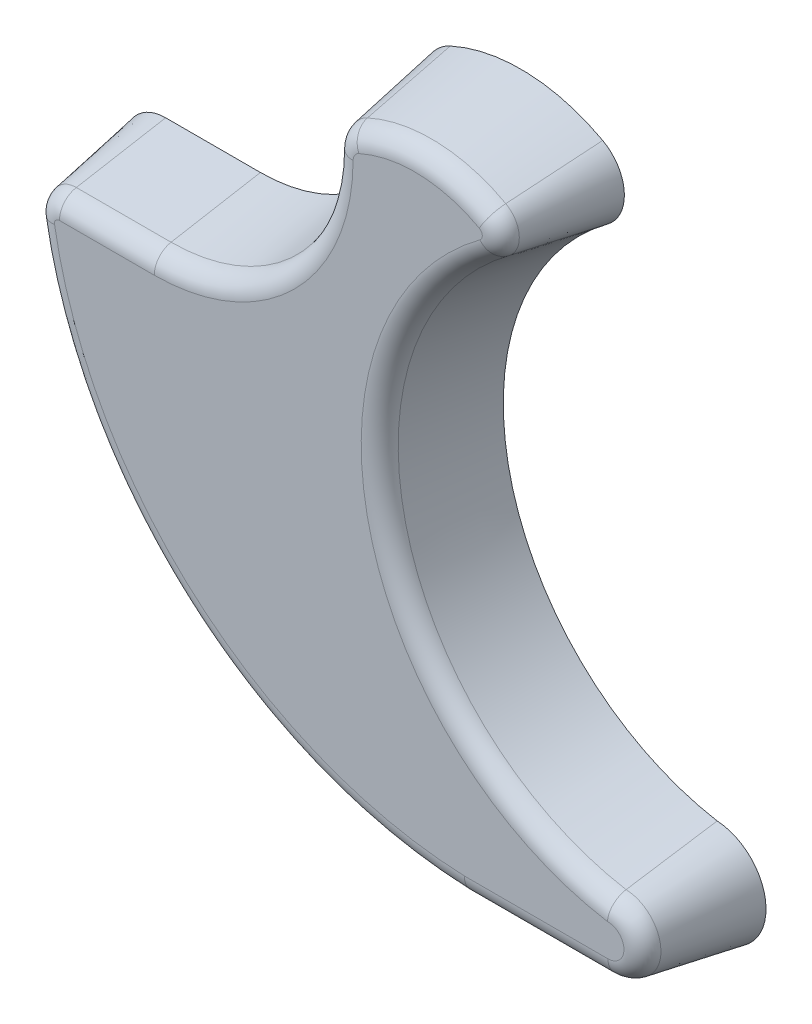
ISO-10303-21;
HEADER;
FILE_DESCRIPTION(('STEP AP214'),'2;1');
FILE_NAME('part.step','',(''),(''),'','','');
FILE_SCHEMA(('AUTOMOTIVE_DESIGN { 1 0 10303 214 1 1 1 1 }'));
ENDSEC;
DATA;
#1=APPLICATION_CONTEXT('core data for automotive mechanical design processes');
#2=APPLICATION_PROTOCOL_DEFINITION('international standard','automotive_design',2000,#1);
#3=PRODUCT_CONTEXT('',#1,'mechanical');
#4=PRODUCT('Part','Part','',(#3));
#5=PRODUCT_RELATED_PRODUCT_CATEGORY('part','',(#4));
#6=PRODUCT_DEFINITION_FORMATION('','',#4);
#7=PRODUCT_DEFINITION_CONTEXT('part definition',#1,'design');
#8=PRODUCT_DEFINITION('design','',#6,#7);
#9=PRODUCT_DEFINITION_SHAPE('','',#8);
#10=(LENGTH_UNIT() NAMED_UNIT(*) SI_UNIT(.MILLI.,.METRE.));
#11=(NAMED_UNIT(*) PLANE_ANGLE_UNIT() SI_UNIT($,.RADIAN.));
#12=(NAMED_UNIT(*) SI_UNIT($,.STERADIAN.) SOLID_ANGLE_UNIT());
#13=UNCERTAINTY_MEASURE_WITH_UNIT(LENGTH_MEASURE(1.E-05),#10,'distance_accuracy_value','');
#14=(GEOMETRIC_REPRESENTATION_CONTEXT(3) GLOBAL_UNCERTAINTY_ASSIGNED_CONTEXT((#13)) GLOBAL_UNIT_ASSIGNED_CONTEXT((#10,
#11,#12)) REPRESENTATION_CONTEXT('',''));
#15=CARTESIAN_POINT('',(0.,0.,0.));
#16=DIRECTION('',(0.,0.,1.));
#17=DIRECTION('',(1.,0.,0.));
#18=AXIS2_PLACEMENT_3D('',#15,#16,#17);
#19=CARTESIAN_POINT('',(-185.360620238029,11.7361066888979,0.));
#20=DIRECTION('',(0.,0.,-1.));
#21=DIRECTION('',(1.,0.,0.));
#22=AXIS2_PLACEMENT_3D('',#19,#20,#21);
#23=CONICAL_SURFACE('',#22,12.7,0.174532925199433);
#24=DIRECTION('',(-0.171170743391447,-0.0292278328629598,-0.984807753012208));
#25=VECTOR('',#24,1.);
#26=CARTESIAN_POINT('',(-197.879429650708,9.59848864794411,0.));
#27=LINE('',#26,#25);
#28=CARTESIAN_POINT('',(-193.052225703188,10.4227458041505,27.772665928185));
#29=VERTEX_POINT('',#28);
#30=CARTESIAN_POINT('',(-197.879429650708,9.59848864794409,0.));
#31=VERTEX_POINT('',#30);
#32=EDGE_CURVE('E147',#29,#31,#27,.T.);
#33=ORIENTED_EDGE('',*,*,#32,.F.);
#34=CARTESIAN_POINT('',(-185.360620238029,11.7361066888979,27.772665928185));
#35=DIRECTION('',(0.,0.,-1.));
#36=DIRECTION('',(-1.,0.,0.));
#37=AXIS2_PLACEMENT_3D('',#34,#35,#36);
#38=CIRCLE('',#37,7.80292967065828);
#39=CARTESIAN_POINT('',(-185.360620238029,19.5390363595562,27.772665928185));
#40=VERTEX_POINT('',#39);
#41=EDGE_CURVE('E46',#29,#40,#38,.T.);
#42=ORIENTED_EDGE('',*,*,#41,.T.);
#43=DIRECTION('',(0.,0.17364817766693,-0.984807753012208));
#44=VECTOR('',#43,1.);
#45=CARTESIAN_POINT('',(-185.360620238029,24.4361066888979,0.));
#46=LINE('',#45,#44);
#47=CARTESIAN_POINT('',(-185.360620238029,24.4361066888979,0.));
#48=VERTEX_POINT('',#47);
#49=EDGE_CURVE('E168',#40,#48,#46,.T.);
#50=ORIENTED_EDGE('',*,*,#49,.T.);
#51=CARTESIAN_POINT('',(-185.360620238029,11.7361066888979,0.));
#52=DIRECTION('',(0.,0.,1.));
#53=DIRECTION('',(1.,0.,0.));
#54=AXIS2_PLACEMENT_3D('',#51,#52,#53);
#55=CIRCLE('',#54,12.7);
#56=EDGE_CURVE('E162',#48,#31,#55,.T.);
#57=ORIENTED_EDGE('',*,*,#56,.T.);
#58=EDGE_LOOP('',(#33,#42,#50,#57));
#59=FACE_BOUND('',#58,.T.);
#60=ADVANCED_FACE('F37',(#59),#23,.T.);
#61=CARTESIAN_POINT('',(-54.3378571428572,34.1085714285715,0.));
#62=DIRECTION('',(0.,0.,-1.));
#63=DIRECTION('',(1.,0.,0.));
#64=AXIS2_PLACEMENT_3D('',#61,#62,#63);
#65=CONICAL_SURFACE('',#64,145.619116862931,0.174532925199433);
#66=CARTESIAN_POINT('',(-59.5693856344838,-105.59030612125,33.02));
#67=CARTESIAN_POINT('',(-59.5875471806484,-106.560692169269,27.5166672478581));
#68=CARTESIAN_POINT('',(-59.6056170011073,-107.531078268531,22.0133342051054));
#69=CARTESIAN_POINT('',(-59.6415731906139,-109.471850569529,11.0066675384387));
#70=CARTESIAN_POINT('',(-59.6594595596615,-110.442236771265,5.50333391452478));
#71=CARTESIAN_POINT('',(-59.6772542030036,-111.412623024244,0.));
#72=B_SPLINE_CURVE_WITH_KNOTS('',3,(#66,#67,#68,#69,#70,#71),.UNSPECIFIED.,.F.,.F.,(4,2,4),(0.,
16.7647801213005,33.5295602424167),.UNSPECIFIED.);
#73=CARTESIAN_POINT('',(-59.5866755915734,-106.515552694902,27.772665928185));
#74=VERTEX_POINT('',#73);
#75=CARTESIAN_POINT('',(-59.6772542030037,-111.412623024244,0.));
#76=VERTEX_POINT('',#75);
#77=EDGE_CURVE('E156',#74,#76,#72,.T.);
#78=ORIENTED_EDGE('',*,*,#77,.F.);
#79=CARTESIAN_POINT('',(-54.3378571428572,34.1085714285715,27.772665928185));
#80=DIRECTION('',(0.,0.,-1.));
#81=DIRECTION('',(-1.,0.,0.));
#82=AXIS2_PLACEMENT_3D('',#79,#80,#81);
#83=CIRCLE('',#82,140.722046533589);
#84=EDGE_CURVE('E54',#74,#29,#83,.T.);
#85=ORIENTED_EDGE('',*,*,#84,.T.);
#86=ORIENTED_EDGE('',*,*,#32,.T.);
#87=CARTESIAN_POINT('',(-54.3378571428572,34.1085714285715,0.));
#88=DIRECTION('',(0.,0.,1.));
#89=DIRECTION('',(1.,0.,0.));
#90=AXIS2_PLACEMENT_3D('',#87,#88,#89);
#91=CIRCLE('',#90,145.619116862931);
#92=EDGE_CURVE('E150',#31,#76,#91,.T.);
#93=ORIENTED_EDGE('',*,*,#92,.T.);
#94=EDGE_LOOP('',(#78,#85,#86,#93));
#95=FACE_BOUND('',#94,.T.);
#96=ADVANCED_FACE('F149',(#95),#65,.T.);
#97=CARTESIAN_POINT('',(-14.8204641625524,-111.412623024244,0.));
#98=DIRECTION('',(0.,-0.984807753012208,0.17364817766693));
#99=DIRECTION('',(0.,-0.17364817766693,-0.984807753012208));
#100=AXIS2_PLACEMENT_3D('',#97,#98,#99);
#101=PLANE('',#100);
#102=DIRECTION('',(0.,-0.17364817766693,-0.984807753012208));
#103=VECTOR('',#102,1.);
#104=CARTESIAN_POINT('',(-14.8204641625524,-111.412623024244,0.));
#105=LINE('',#104,#103);
#106=CARTESIAN_POINT('',(-14.8204641625524,-106.515552694902,27.772665928185));
#107=VERTEX_POINT('',#106);
#108=CARTESIAN_POINT('',(-14.8204641625524,-111.412623024244,0.));
#109=VERTEX_POINT('',#108);
#110=EDGE_CURVE('E213',#107,#109,#105,.T.);
#111=ORIENTED_EDGE('',*,*,#110,.F.);
#112=DIRECTION('',(1.,0.,0.));
#113=VECTOR('',#112,1.);
#114=CARTESIAN_POINT('',(-59.5693856344838,-106.515552694902,27.772665928185));
#115=LINE('',#114,#113);
#116=EDGE_CURVE('E62',#107,#74,#115,.F.);
#117=ORIENTED_EDGE('',*,*,#116,.T.);
#118=ORIENTED_EDGE('',*,*,#77,.T.);
#119=DIRECTION('',(1.,0.,0.));
#120=VECTOR('',#119,1.);
#121=CARTESIAN_POINT('',(-14.8204641625524,-111.412623024244,0.));
#122=LINE('',#121,#120);
#123=EDGE_CURVE('E165',#76,#109,#122,.T.);
#124=ORIENTED_EDGE('',*,*,#123,.T.);
#125=EDGE_LOOP('',(#111,#117,#118,#124));
#126=FACE_BOUND('',#125,.T.);
#127=ADVANCED_FACE('F224',(#126),#101,.T.);
#128=CARTESIAN_POINT('',(-14.8204641625524,-95.2797373334966,0.));
#129=DIRECTION('',(0.,0.,-1.));
#130=DIRECTION('',(1.,0.,0.));
#131=AXIS2_PLACEMENT_3D('',#128,#129,#130);
#132=CONICAL_SURFACE('',#131,16.1328856907471,0.174532925199433);
#133=CARTESIAN_POINT('',(-14.5084201854811,-84.9738915514478,33.02));
#134=CARTESIAN_POINT('',(-14.4576699848428,-84.4667315076806,30.1363427169767));
#135=CARTESIAN_POINT('',(-14.4055154966712,-83.9597875854176,27.2526724951651));
#136=CARTESIAN_POINT('',(-14.298771530745,-82.946275030161,21.4853126478576));
#137=CARTESIAN_POINT('',(-14.2441820542456,-82.4397063969741,18.6016230223724));
#138=CARTESIAN_POINT('',(-14.1380346976066,-81.4732580751137,13.0982834606489));
#139=CARTESIAN_POINT('',(-14.0866569393928,-81.0133506172318,10.4786349139742));
#140=CARTESIAN_POINT('',(-13.9823836772579,-80.093769615867,5.23932569271442));
#141=CARTESIAN_POINT('',(-13.9294881726286,-79.6340960724934,2.61966501812434));
#142=CARTESIAN_POINT('',(-13.8759255527134,-79.1745255210044,0.));
#143=B_SPLINE_CURVE_WITH_KNOTS('',3,(#133,#134,#135,#136,#137,#138,#139,#140,#141,#142),
.UNSPECIFIED.,.F.,.F.,(4,2,2,2,4),(0.,8.78506579771062,17.5701270661008,25.5507542714873,
33.5313852005815),.UNSPECIFIED.);
#144=CARTESIAN_POINT('',(-14.414570908634,-84.0512558020502,27.772665928185));
#145=VERTEX_POINT('',#144);
#146=CARTESIAN_POINT('',(-13.8759255527136,-79.1745255210044,0.));
#147=VERTEX_POINT('',#146);
#148=EDGE_CURVE('E205',#145,#147,#143,.T.);
#149=ORIENTED_EDGE('',*,*,#148,.F.);
#150=CARTESIAN_POINT('',(-14.8204641625524,-95.2797373334966,27.772665928185));
#151=DIRECTION('',(0.,0.,-1.));
#152=DIRECTION('',(-1.,0.,0.));
#153=AXIS2_PLACEMENT_3D('',#150,#151,#152);
#154=CIRCLE('',#153,11.2358153614054);
#155=EDGE_CURVE('E254',#145,#107,#154,.T.);
#156=ORIENTED_EDGE('',*,*,#155,.T.);
#157=ORIENTED_EDGE('',*,*,#110,.T.);
#158=CARTESIAN_POINT('',(-14.8204641625524,-95.2797373334966,0.));
#159=DIRECTION('',(0.,0.,1.));
#160=DIRECTION('',(1.,0.,0.));
#161=AXIS2_PLACEMENT_3D('',#158,#159,#160);
#162=CIRCLE('',#161,16.1328856907471);
#163=EDGE_CURVE('E175',#109,#147,#162,.T.);
#164=ORIENTED_EDGE('',*,*,#163,.T.);
#165=EDGE_LOOP('',(#149,#156,#157,#164));
#166=FACE_BOUND('',#165,.T.);
#167=ADVANCED_FACE('F215',(#166),#132,.T.);
#168=CARTESIAN_POINT('',(0.,0.,0.));
#169=DIRECTION('',(0.,0.,1.));
#170=DIRECTION('',(1.,0.,0.));
#171=AXIS2_PLACEMENT_3D('',#168,#169,#170);
#172=CONICAL_SURFACE('',#171,80.3812590186333,0.174532925199433);
#173=DIRECTION('',(0.103597979577627,-0.139359779830765,-0.984807753012208));
#174=VECTOR('',#173,1.);
#175=CARTESIAN_POINT('',(-47.9552169341434,64.5092549191189,0.));
#176=LINE('',#175,#174);
#177=CARTESIAN_POINT('',(-50.8767943372904,68.4393545728096,27.772665928185));
#178=VERTEX_POINT('',#177);
#179=CARTESIAN_POINT('',(-47.9552169341434,64.5092549191189,0.));
#180=VERTEX_POINT('',#179);
#181=EDGE_CURVE('E203',#178,#180,#176,.T.);
#182=ORIENTED_EDGE('',*,*,#181,.F.);
#183=CARTESIAN_POINT('',(0.,0.,27.772665928185));
#184=DIRECTION('',(0.,0.,1.));
#185=DIRECTION('',(1.,0.,0.));
#186=AXIS2_PLACEMENT_3D('',#183,#184,#185);
#187=CIRCLE('',#186,85.2783293479751);
#188=EDGE_CURVE('E252',#178,#145,#187,.T.);
#189=ORIENTED_EDGE('',*,*,#188,.T.);
#190=ORIENTED_EDGE('',*,*,#148,.T.);
#191=CARTESIAN_POINT('',(0.,0.,0.));
#192=DIRECTION('',(0.,0.,-1.));
#193=DIRECTION('',(1.,0.,0.));
#194=AXIS2_PLACEMENT_3D('',#191,#192,#193);
#195=CIRCLE('',#194,80.3812590186333);
#196=EDGE_CURVE('E178',#147,#180,#195,.T.);
#197=ORIENTED_EDGE('',*,*,#196,.T.);
#198=EDGE_LOOP('',(#182,#189,#190,#197));
#199=FACE_BOUND('',#198,.T.);
#200=ADVANCED_FACE('F218',(#199),#172,.F.);
#201=CARTESIAN_POINT('',(-55.6835343025102,74.9053708598825,0.));
#202=DIRECTION('',(0.,0.,-1.));
#203=DIRECTION('',(1.,0.,0.));
#204=AXIS2_PLACEMENT_3D('',#201,#202,#203);
#205=CONICAL_SURFACE('',#204,12.954,0.174532925199433);
#206=DIRECTION('',(0.083292428567465,0.152368175648262,-0.984807753012208));
#207=VECTOR('',#206,1.);
#208=CARTESIAN_POINT('',(-49.4699930252013,86.2719015880853,0.));
#209=LINE('',#208,#207);
#210=CARTESIAN_POINT('',(-51.8189314711832,81.9749508102072,27.772665928185));
#211=VERTEX_POINT('',#210);
#212=CARTESIAN_POINT('',(-49.4699930252013,86.2719015880853,0.));
#213=VERTEX_POINT('',#212);
#214=EDGE_CURVE('E201',#211,#213,#209,.T.);
#215=ORIENTED_EDGE('',*,*,#214,.F.);
#216=CARTESIAN_POINT('',(-55.6835343025102,74.9053708598825,27.772665928185));
#217=DIRECTION('',(0.,0.,-1.));
#218=DIRECTION('',(-1.,0.,0.));
#219=AXIS2_PLACEMENT_3D('',#216,#217,#218);
#220=CIRCLE('',#219,8.05692967065828);
#221=EDGE_CURVE('E250',#211,#178,#220,.T.);
#222=ORIENTED_EDGE('',*,*,#221,.T.);
#223=ORIENTED_EDGE('',*,*,#181,.T.);
#224=CARTESIAN_POINT('',(-55.6835343025102,74.9053708598825,0.));
#225=DIRECTION('',(0.,0.,1.));
#226=DIRECTION('',(1.,0.,0.));
#227=AXIS2_PLACEMENT_3D('',#224,#225,#226);
#228=CIRCLE('',#227,12.954);
#229=EDGE_CURVE('E181',#180,#213,#228,.T.);
#230=ORIENTED_EDGE('',*,*,#229,.T.);
#231=EDGE_LOOP('',(#215,#222,#223,#230));
#232=FACE_BOUND('',#231,.T.);
#233=ADVANCED_FACE('F222',(#232),#205,.T.);
#234=CARTESIAN_POINT('',(-74.9012734880693,39.7500523015337,0.));
#235=DIRECTION('',(0.,0.,-1.));
#236=DIRECTION('',(-1.,0.,0.));
#237=AXIS2_PLACEMENT_3D('',#234,#235,#236);
#238=CONICAL_SURFACE('',#237,53.0191709386489,0.174532925199433);
#239=DIRECTION('',(-0.0719851822336261,0.158024754851376,-0.984807753012208));
#240=VECTOR('',#239,1.);
#241=CARTESIAN_POINT('',(-96.8801662882858,87.9989979718617,0.));
#242=LINE('',#241,#240);
#243=CARTESIAN_POINT('',(-94.85010467287,83.5425254152162,27.772665928185));
#244=VERTEX_POINT('',#243);
#245=CARTESIAN_POINT('',(-96.8801662882858,87.9989979718617,0.));
#246=VERTEX_POINT('',#245);
#247=EDGE_CURVE('E199',#244,#246,#242,.T.);
#248=ORIENTED_EDGE('',*,*,#247,.F.);
#249=CARTESIAN_POINT('',(-74.9012734880693,39.7500523015337,27.772665928185));
#250=DIRECTION('',(0.,0.,-1.));
#251=DIRECTION('',(-1.,0.,0.));
#252=AXIS2_PLACEMENT_3D('',#249,#250,#251);
#253=CIRCLE('',#252,48.1221006093071);
#254=EDGE_CURVE('E248',#244,#211,#253,.T.);
#255=ORIENTED_EDGE('',*,*,#254,.T.);
#256=ORIENTED_EDGE('',*,*,#214,.T.);
#257=CARTESIAN_POINT('',(-74.9012734880693,39.7500523015337,0.));
#258=DIRECTION('',(0.,0.,1.));
#259=DIRECTION('',(-1.,0.,0.));
#260=AXIS2_PLACEMENT_3D('',#257,#258,#259);
#261=CIRCLE('',#260,53.0191709386489);
#262=EDGE_CURVE('E184',#213,#246,#261,.T.);
#263=ORIENTED_EDGE('',*,*,#262,.T.);
#264=EDGE_LOOP('',(#248,#255,#256,#263));
#265=FACE_BOUND('',#264,.T.);
#266=ADVANCED_FACE('F279',(#265),#238,.T.);
#267=CARTESIAN_POINT('',(-90.9836619549375,75.054755520223,0.));
#268=DIRECTION('',(0.,0.,-1.));
#269=DIRECTION('',(-1.,0.,0.));
#270=AXIS2_PLACEMENT_3D('',#267,#268,#269);
#271=CONICAL_SURFACE('',#270,14.224,0.174532925199433);
#272=DIRECTION('',(-0.173647503199055,0.000483983243590093,-0.984807753012208));
#273=VECTOR('',#272,1.);
#274=CARTESIAN_POINT('',(-105.207606707418,75.0943999193139,0.));
#275=LINE('',#274,#273);
#276=CARTESIAN_POINT('',(-100.310555398815,75.080751057495,27.772665928185));
#277=VERTEX_POINT('',#276);
#278=CARTESIAN_POINT('',(-105.207606707418,75.0943999193139,0.));
#279=VERTEX_POINT('',#278);
#280=EDGE_CURVE('E197',#277,#279,#275,.T.);
#281=ORIENTED_EDGE('',*,*,#280,.F.);
#282=CARTESIAN_POINT('',(-90.9836619549375,75.054755520223,27.772665928185));
#283=DIRECTION('',(0.,0.,-1.));
#284=DIRECTION('',(-1.,0.,0.));
#285=AXIS2_PLACEMENT_3D('',#282,#283,#284);
#286=CIRCLE('',#285,9.32692967065828);
#287=EDGE_CURVE('E245',#277,#244,#286,.T.);
#288=ORIENTED_EDGE('',*,*,#287,.T.);
#289=ORIENTED_EDGE('',*,*,#247,.T.);
#290=CARTESIAN_POINT('',(-90.9836619549375,75.054755520223,0.));
#291=DIRECTION('',(0.,0.,1.));
#292=DIRECTION('',(-1.,0.,0.));
#293=AXIS2_PLACEMENT_3D('',#290,#291,#292);
#294=CIRCLE('',#293,14.224);
#295=EDGE_CURVE('E187',#246,#279,#294,.T.);
#296=ORIENTED_EDGE('',*,*,#295,.T.);
#297=EDGE_LOOP('',(#281,#288,#289,#296));
#298=FACE_BOUND('',#297,.T.);
#299=ADVANCED_FACE('F275',(#298),#271,.T.);
#300=CARTESIAN_POINT('',(-156.007409394849,75.235987058924,0.));
#301=DIRECTION('',(0.,0.,1.));
#302=DIRECTION('',(1.,0.,0.));
#303=AXIS2_PLACEMENT_3D('',#300,#301,#302);
#304=CONICAL_SURFACE('',#303,50.8,0.174532925199433);
#305=CARTESIAN_POINT('',(-156.007409394849,75.235987058924,0.));
#306=DIRECTION('',(0.,0.,-1.));
#307=DIRECTION('',(1.,0.,0.));
#308=AXIS2_PLACEMENT_3D('',#305,#306,#307);
#309=CIRCLE('',#308,50.8);
#310=CARTESIAN_POINT('',(-155.897162440074,24.4361066888979,0.));
#311=VERTEX_POINT('',#310);
#312=EDGE_CURVE('E190',#279,#311,#309,.T.);
#313=ORIENTED_EDGE('',*,*,#312,.T.);
#314=DIRECTION('',(0.,0.17364817766693,-0.984807753012208));
#315=VECTOR('',#314,1.);
#316=CARTESIAN_POINT('',(-155.897162440074,24.4361066888979,0.));
#317=LINE('',#316,#315);
#318=CARTESIAN_POINT('',(-155.897162440074,19.5390363595562,27.772665928185));
#319=VERTEX_POINT('',#318);
#320=EDGE_CURVE('E196',#319,#311,#317,.T.);
#321=ORIENTED_EDGE('',*,*,#320,.F.);
#322=CARTESIAN_POINT('',(-155.897162419882,19.5390261584773,27.772664129456));
#323=CARTESIAN_POINT('',(-155.896946103333,19.5390265734407,27.7726642044031));
#324=CARTESIAN_POINT('',(-155.896729786787,19.5390269896643,27.7726642793501));
#325=CARTESIAN_POINT('',(-155.8962971537,19.5390278246318,27.7726644292442));
#326=CARTESIAN_POINT('',(-155.896080837158,19.5390282433757,27.7726645041912));
#327=CARTESIAN_POINT('',(-155.89564820408,19.539029083384,27.7726646540853));
#328=CARTESIAN_POINT('',(-155.895431887544,19.5390295046484,27.7726647290324));
#329=CARTESIAN_POINT('',(-155.894999254475,19.5390303496975,27.7726648789264));
#330=CARTESIAN_POINT('',(-155.894782937943,19.5390307734823,27.7726649538735));
#331=CARTESIAN_POINT('',(-155.894350304884,19.5390316235722,27.7726651037676));
#332=CARTESIAN_POINT('',(-155.894133988357,19.5390320498773,27.7726651787146));
#333=CARTESIAN_POINT('',(-155.893701355308,19.539032905008,27.7726653286087));
#334=CARTESIAN_POINT('',(-155.893485038785,19.5390333338336,27.7726654035557));
#335=CARTESIAN_POINT('',(-155.893052405746,19.5390341940051,27.7726655534498));
#336=CARTESIAN_POINT('',(-155.892836089228,19.539034625351,27.7726656283968));
#337=CARTESIAN_POINT('',(-155.892403456199,19.5390354905633,27.7726657782909));
#338=CARTESIAN_POINT('',(-155.892187139686,19.5390359244297,27.772665853238));
#339=CARTESIAN_POINT('',(-155.891970823176,19.5390363595562,27.772665928185));
#340=B_SPLINE_CURVE_WITH_KNOTS('',3,(#322,#323,#324,#325,#326,#327,#328,#329,#330,#331,#332,
#333,#334,#335,#336,#337,#338,#339),.UNSPECIFIED.,.F.,.F.,(4,2,2,2,2,2,2,2,4),(0.,
0.000648950878562804,0.00129790175753535,0.00194685263697801,0.00259580351692334,
0.0032447543973207,0.00389370527814713,0.00454265615943524,0.00519160704124536),.UNSPECIFIED.);
#341=CARTESIAN_POINT('',(-155.891970823176,19.5390363595562,27.772665928185));
#342=VERTEX_POINT('',#341);
#343=EDGE_CURVE('E11',#319,#342,#340,.T.);
#344=ORIENTED_EDGE('',*,*,#343,.T.);
#345=CARTESIAN_POINT('',(-156.007409394849,75.235987058924,27.772665928185));
#346=DIRECTION('',(0.,0.,1.));
#347=DIRECTION('',(1.,0.,0.));
#348=AXIS2_PLACEMENT_3D('',#345,#346,#347);
#349=CIRCLE('',#348,55.6970703293417);
#350=EDGE_CURVE('E243',#342,#277,#349,.T.);
#351=ORIENTED_EDGE('',*,*,#350,.T.);
#352=ORIENTED_EDGE('',*,*,#280,.T.);
#353=EDGE_LOOP('',(#313,#321,#344,#351,#352));
#354=FACE_BOUND('',#353,.T.);
#355=ADVANCED_FACE('F264',(#354),#304,.F.);
#356=CARTESIAN_POINT('',(-185.360620238029,24.4361066888979,0.));
#357=DIRECTION('',(0.,0.984807753012208,0.17364817766693));
#358=DIRECTION('',(0.,-0.17364817766693,0.984807753012208));
#359=AXIS2_PLACEMENT_3D('',#356,#357,#358);
#360=PLANE('',#359);
#361=ORIENTED_EDGE('',*,*,#49,.F.);
#362=DIRECTION('',(-1.,0.,0.));
#363=VECTOR('',#362,1.);
#364=CARTESIAN_POINT('',(-155.897162440074,19.5390363595562,27.772665928185));
#365=LINE('',#364,#363);
#366=EDGE_CURVE('E246',#40,#319,#365,.F.);
#367=ORIENTED_EDGE('',*,*,#366,.T.);
#368=ORIENTED_EDGE('',*,*,#320,.T.);
#369=DIRECTION('',(-1.,0.,0.));
#370=VECTOR('',#369,1.);
#371=CARTESIAN_POINT('',(-185.360620238029,24.4361066888979,0.));
#372=LINE('',#371,#370);
#373=EDGE_CURVE('E193',#311,#48,#372,.T.);
#374=ORIENTED_EDGE('',*,*,#373,.T.);
#375=EDGE_LOOP('',(#361,#367,#368,#374));
#376=FACE_BOUND('',#375,.T.);
#377=ADVANCED_FACE('F274',(#376),#360,.T.);
#378=CARTESIAN_POINT('',(-185.360620238029,11.7361066888979,33.02));
#379=DIRECTION('',(0.,0.,1.));
#380=DIRECTION('',(1.,0.,0.));
#381=AXIS2_PLACEMENT_3D('',#378,#379,#380);
#382=PLANE('',#381);
#383=CARTESIAN_POINT('',(-156.007409394849,75.235987058924,33.02));
#384=DIRECTION('',(0.,0.,1.));
#385=DIRECTION('',(1.,0.,0.));
#386=AXIS2_PLACEMENT_3D('',#383,#384,#385);
#387=CIRCLE('',#386,61.9505995609693);
#388=CARTESIAN_POINT('',(-94.0570504565561,75.0633215433931,33.02));
#389=VERTEX_POINT('',#388);
#390=CARTESIAN_POINT('',(-155.885662596501,13.2855071279287,33.02));
#391=VERTEX_POINT('',#390);
#392=EDGE_CURVE('E399',#389,#391,#387,.F.);
#393=ORIENTED_EDGE('',*,*,#392,.T.);
#394=DIRECTION('',(1.,0.,0.));
#395=VECTOR('',#394,1.);
#396=CARTESIAN_POINT('',(-185.360620238029,13.2855071279287,33.02));
#397=LINE('',#396,#395);
#398=CARTESIAN_POINT('',(-185.360620238029,13.2855071279287,33.02));
#399=VERTEX_POINT('',#398);
#400=EDGE_CURVE('E241',#391,#399,#397,.F.);
#401=ORIENTED_EDGE('',*,*,#400,.T.);
#402=CARTESIAN_POINT('',(-185.360620238029,11.7361066888979,33.02));
#403=DIRECTION('',(0.,0.,1.));
#404=DIRECTION('',(1.,0.,0.));
#405=AXIS2_PLACEMENT_3D('',#402,#403,#404);
#406=CIRCLE('',#405,1.54940043903076);
#407=CARTESIAN_POINT('',(-186.887915419143,11.4753172140055,33.02));
#408=VERTEX_POINT('',#407);
#409=EDGE_CURVE('E155',#399,#408,#406,.T.);
#410=ORIENTED_EDGE('',*,*,#409,.T.);
#411=CARTESIAN_POINT('',(-54.3378571428572,34.1085714285715,33.02));
#412=DIRECTION('',(0.,0.,1.));
#413=DIRECTION('',(1.,0.,0.));
#414=AXIS2_PLACEMENT_3D('',#411,#412,#413);
#415=CIRCLE('',#414,134.468517301962);
#416=CARTESIAN_POINT('',(-59.4686829827589,-100.262023463274,33.02));
#417=VERTEX_POINT('',#416);
#418=EDGE_CURVE('E408',#408,#417,#415,.T.);
#419=ORIENTED_EDGE('',*,*,#418,.T.);
#420=DIRECTION('',(-1.,0.,0.));
#421=VECTOR('',#420,1.);
#422=CARTESIAN_POINT('',(-14.8204641625524,-100.262023463274,33.02));
#423=LINE('',#422,#421);
#424=CARTESIAN_POINT('',(-14.8204641625524,-100.262023463274,33.02));
#425=VERTEX_POINT('',#424);
#426=EDGE_CURVE('E407',#417,#425,#423,.F.);
#427=ORIENTED_EDGE('',*,*,#426,.T.);
#428=CARTESIAN_POINT('',(-14.8204641625524,-95.2797373334966,33.02));
#429=DIRECTION('',(0.,0.,1.));
#430=DIRECTION('',(1.,0.,0.));
#431=AXIS2_PLACEMENT_3D('',#428,#429,#430);
#432=CIRCLE('',#431,4.98228612977788);
#433=CARTESIAN_POINT('',(-14.9684485218816,-90.2996494117455,33.02));
#434=VERTEX_POINT('',#433);
#435=EDGE_CURVE('E405',#425,#434,#432,.T.);
#436=ORIENTED_EDGE('',*,*,#435,.T.);
#437=CARTESIAN_POINT('',(0.,0.,33.02));
#438=DIRECTION('',(0.,0.,1.));
#439=DIRECTION('',(1.,0.,0.));
#440=AXIS2_PLACEMENT_3D('',#437,#438,#439);
#441=CIRCLE('',#440,91.5318585796026);
#442=CARTESIAN_POINT('',(-54.6076310344014,73.4580680922596,33.02));
#443=VERTEX_POINT('',#442);
#444=EDGE_CURVE('E379',#434,#443,#441,.F.);
#445=ORIENTED_EDGE('',*,*,#444,.T.);
#446=CARTESIAN_POINT('',(-55.6835343025102,74.9053708598825,33.02));
#447=DIRECTION('',(0.,0.,1.));
#448=DIRECTION('',(1.,0.,0.));
#449=AXIS2_PLACEMENT_3D('',#446,#447,#448);
#450=CIRCLE('',#449,1.80340043903076);
#451=CARTESIAN_POINT('',(-54.8185116788083,76.4877706209986,33.02));
#452=VERTEX_POINT('',#451);
#453=EDGE_CURVE('E375',#443,#452,#450,.T.);
#454=ORIENTED_EDGE('',*,*,#453,.T.);
#455=CARTESIAN_POINT('',(-74.9012734880693,39.7500523015337,33.02));
#456=DIRECTION('',(0.,0.,1.));
#457=DIRECTION('',(1.,0.,0.));
#458=AXIS2_PLACEMENT_3D('',#455,#456,#457);
#459=CIRCLE('',#458,41.8685713776796);
#460=CARTESIAN_POINT('',(-92.2577282518202,77.8516368780539,33.02));
#461=VERTEX_POINT('',#460);
#462=EDGE_CURVE('E364',#452,#461,#459,.T.);
#463=ORIENTED_EDGE('',*,*,#462,.T.);
#464=CARTESIAN_POINT('',(-90.9836619549375,75.054755520223,33.02));
#465=DIRECTION('',(0.,0.,1.));
#466=DIRECTION('',(1.,0.,0.));
#467=AXIS2_PLACEMENT_3D('',#464,#465,#466);
#468=CIRCLE('',#467,3.07340043903076);
#469=EDGE_CURVE('E361',#461,#389,#468,.T.);
#470=ORIENTED_EDGE('',*,*,#469,.T.);
#471=EDGE_LOOP('',(#393,#401,#410,#419,#427,#436,#445,#454,#463,#470));
#472=FACE_BOUND('',#471,.T.);
#473=ADVANCED_FACE('F410',(#472),#382,.T.);
#474=CARTESIAN_POINT('',(-185.360620238029,11.7361066888979,0.));
#475=DIRECTION('',(0.,0.,1.));
#476=DIRECTION('',(1.,0.,0.));
#477=AXIS2_PLACEMENT_3D('',#474,#475,#476);
#478=PLANE('',#477);
#479=ORIENTED_EDGE('',*,*,#56,.F.);
#480=ORIENTED_EDGE('',*,*,#373,.F.);
#481=ORIENTED_EDGE('',*,*,#312,.F.);
#482=ORIENTED_EDGE('',*,*,#295,.F.);
#483=ORIENTED_EDGE('',*,*,#262,.F.);
#484=ORIENTED_EDGE('',*,*,#229,.F.);
#485=ORIENTED_EDGE('',*,*,#196,.F.);
#486=ORIENTED_EDGE('',*,*,#163,.F.);
#487=ORIENTED_EDGE('',*,*,#123,.F.);
#488=ORIENTED_EDGE('',*,*,#92,.F.);
#489=EDGE_LOOP('',(#479,#480,#481,#482,#483,#484,#485,#486,#487,#488));
#490=FACE_BOUND('',#489,.T.);
#491=ADVANCED_FACE('F160',(#490),#478,.F.);
#492=CARTESIAN_POINT('',(0.,0.,26.67));
#493=DIRECTION('',(0.,0.,1.));
#494=DIRECTION('',(1.,0.,0.));
#495=AXIS2_PLACEMENT_3D('',#492,#493,#494);
#496=TOROIDAL_SURFACE('',#495,91.5318585796026,6.35);
#497=CARTESIAN_POINT('',(-14.414570908634,-84.0512558020505,27.772665928185));
#498=CARTESIAN_POINT('',(-14.4177592673173,-84.0821159078152,27.9483322911613));
#499=CARTESIAN_POINT('',(-14.4217114335728,-84.120391067689,28.1226781887803));
#500=CARTESIAN_POINT('',(-14.4310837832463,-84.2114138885737,28.4675003173588));
#501=CARTESIAN_POINT('',(-14.4365038874961,-84.2641607691029,28.6379767564672));
#502=CARTESIAN_POINT('',(-14.4487486173495,-84.383731283725,28.9737337794432));
#503=CARTESIAN_POINT('',(-14.4555722646661,-84.4505451137397,29.1390178904232));
#504=CARTESIAN_POINT('',(-14.470545828857,-84.5977885430074,29.4633408378647));
#505=CARTESIAN_POINT('',(-14.4786957314026,-84.6782179951591,29.6223797417757));
#506=CARTESIAN_POINT('',(-14.4962291761731,-84.8521471296292,29.9331315934658));
#507=CARTESIAN_POINT('',(-14.5056130747983,-84.945650588453,30.084842407385));
#508=CARTESIAN_POINT('',(-14.5255055013167,-85.1450809751672,30.3798694580326));
#509=CARTESIAN_POINT('',(-14.5360144420058,-85.2510124644767,30.5231825834654));
#510=CARTESIAN_POINT('',(-14.5580231119831,-85.4744596552856,30.8002684164887));
#511=CARTESIAN_POINT('',(-14.5695223222468,-85.5919692929932,30.9340460554653));
#512=CARTESIAN_POINT('',(-14.5933780546526,-85.8377880192438,31.1912038645786));
#513=CARTESIAN_POINT('',(-14.6057345964772,-85.9660973557392,31.3145837958622));
#514=CARTESIAN_POINT('',(-14.6311660019643,-86.2327308393104,31.5501881395685));
#515=CARTESIAN_POINT('',(-14.6442415355269,-86.3710643656195,31.6624018650888));
#516=CARTESIAN_POINT('',(-14.6709376071249,-86.6566586125537,31.8747540734807));
#517=CARTESIAN_POINT('',(-14.6845581453964,-86.8039193370466,31.9748925511204));
#518=CARTESIAN_POINT('',(-14.7121817962223,-87.1064415567775,32.1624665010515));
#519=CARTESIAN_POINT('',(-14.7261851908015,-87.261709028966,32.2498922919252));
#520=CARTESIAN_POINT('',(-14.7543817459822,-87.5790419033314,32.4113411482137));
#521=CARTESIAN_POINT('',(-14.7685749031546,-87.7411071827797,32.4853644554707));
#522=CARTESIAN_POINT('',(-14.7970094522116,-88.0714682669342,32.6197325822411));
#523=CARTESIAN_POINT('',(-14.8112508405275,-88.2397837447005,32.680029033449));
#524=CARTESIAN_POINT('',(-14.8395264926467,-88.5808577046778,32.7861792600713));
#525=CARTESIAN_POINT('',(-14.8535608315701,-88.7536145098547,32.8320384027931));
#526=CARTESIAN_POINT('',(-14.8811903506975,-89.1020406214465,32.9089545537466));
#527=CARTESIAN_POINT('',(-14.89478638582,-89.2777031015817,32.940042235935));
#528=CARTESIAN_POINT('',(-14.9213504145632,-89.6309897725509,32.987342442525));
#529=CARTESIAN_POINT('',(-14.9343187422915,-89.8086128565911,33.0035629645519));
#530=CARTESIAN_POINT('',(-14.9533612524082,-90.0788044905226,33.016845502827));
#531=CARTESIAN_POINT('',(-14.9597460391744,-90.1711105988257,33.0193732005778));
#532=CARTESIAN_POINT('',(-14.9668192813727,-90.275504338825,33.0199657358755));
#533=CARTESIAN_POINT('',(-14.9676350261957,-90.2875768340539,33.0199999965644));
#534=CARTESIAN_POINT('',(-14.9684485218815,-90.2996494117455,33.02));
#535=B_SPLINE_CURVE_WITH_KNOTS('',3,(#497,#498,#499,#500,#501,#502,#503,#504,#505,#506,#507,
#508,#509,#510,#511,#512,#513,#514,#515,#516,#517,#518,#519,#520,#521,#522,#523,#524,#525,#526,
#527,#528,#529,#530,#531,#532,#533,#534),.UNSPECIFIED.,.F.,.F.,(4,2,2,2,2,2,2,2,2,2,2,2,2,2,2,2,
2,2,4),(0.,0.534990656724158,1.06995246626965,1.60454265669909,2.13912707186061,
2.67386622518266,3.20880225968921,3.74345960793111,4.27812923482547,4.81330575614997,
5.34848250934251,5.88406471850095,6.41963726234172,6.95706872012256,7.49430014230473,
8.03041103741941,8.56623336802646,8.84383522111344,8.88013525582984),.UNSPECIFIED.);
#536=EDGE_CURVE('E172',#145,#434,#535,.T.);
#537=ORIENTED_EDGE('',*,*,#536,.F.);
#538=ORIENTED_EDGE('',*,*,#188,.F.);
#539=CARTESIAN_POINT('',(-54.6076310344014,73.4580680922596,26.67));
#540=DIRECTION('',(0.802540986626806,0.596596986904956,0.));
#541=DIRECTION('',(-0.596596986904956,0.802540986626806,0.));
#542=AXIS2_PLACEMENT_3D('',#539,#540,#541);
#543=CIRCLE('',#542,6.35);
#544=EDGE_CURVE('E41',#443,#178,#543,.T.);
#545=ORIENTED_EDGE('',*,*,#544,.F.);
#546=ORIENTED_EDGE('',*,*,#444,.F.);
#547=EDGE_LOOP('',(#537,#538,#545,#546));
#548=FACE_BOUND('',#547,.T.);
#549=ADVANCED_FACE('F339',(#548),#496,.T.);
#550=CARTESIAN_POINT('',(-55.6835343025102,74.9053708598825,26.67));
#551=DIRECTION('',(0.,0.,1.));
#552=DIRECTION('',(1.,0.,0.));
#553=AXIS2_PLACEMENT_3D('',#550,#551,#552);
#554=DEGENERATE_TOROIDAL_SURFACE('',#553,1.80340043903076,6.35,.T.);
#555=ORIENTED_EDGE('',*,*,#544,.T.);
#556=ORIENTED_EDGE('',*,*,#221,.F.);
#557=CARTESIAN_POINT('',(-54.8185116788083,76.4877706209986,26.67));
#558=DIRECTION('',(-0.877453352493654,0.479661979103668,0.));
#559=DIRECTION('',(-0.479661979103668,-0.877453352493654,0.));
#560=AXIS2_PLACEMENT_3D('',#557,#558,#559);
#561=CIRCLE('',#560,6.35);
#562=EDGE_CURVE('E350',#452,#211,#561,.T.);
#563=ORIENTED_EDGE('',*,*,#562,.F.);
#564=ORIENTED_EDGE('',*,*,#453,.F.);
#565=EDGE_LOOP('',(#555,#556,#563,#564));
#566=FACE_BOUND('',#565,.T.);
#567=ADVANCED_FACE('F39',(#566),#554,.T.);
#568=CARTESIAN_POINT('',(-14.8204641625524,-95.2797373334966,26.67));
#569=DIRECTION('',(0.,0.,1.));
#570=DIRECTION('',(1.,0.,0.));
#571=AXIS2_PLACEMENT_3D('',#568,#569,#570);
#572=DEGENERATE_TOROIDAL_SURFACE('',#571,4.98228612977788,6.35,.T.);
#573=ORIENTED_EDGE('',*,*,#536,.T.);
#574=ORIENTED_EDGE('',*,*,#435,.F.);
#575=CARTESIAN_POINT('',(-14.8204641625524,-100.262023463274,26.67));
#576=DIRECTION('',(-1.,0.,0.));
#577=DIRECTION('',(0.,-1.,0.));
#578=AXIS2_PLACEMENT_3D('',#575,#576,#577);
#579=CIRCLE('',#578,6.35);
#580=EDGE_CURVE('E352',#107,#425,#579,.T.);
#581=ORIENTED_EDGE('',*,*,#580,.F.);
#582=ORIENTED_EDGE('',*,*,#155,.F.);
#583=EDGE_LOOP('',(#573,#574,#581,#582));
#584=FACE_BOUND('',#583,.T.);
#585=ADVANCED_FACE('F337',(#584),#572,.T.);
#586=CARTESIAN_POINT('',(-74.9012734880693,39.7500523015337,26.67));
#587=DIRECTION('',(0.,0.,1.));
#588=DIRECTION('',(1.,0.,0.));
#589=AXIS2_PLACEMENT_3D('',#586,#587,#588);
#590=TOROIDAL_SURFACE('',#589,41.8685713776796,6.35);
#591=ORIENTED_EDGE('',*,*,#562,.T.);
#592=ORIENTED_EDGE('',*,*,#254,.F.);
#593=CARTESIAN_POINT('',(-92.2577282518202,77.8516368780539,26.67));
#594=DIRECTION('',(-0.910028293844113,-0.41454614267072,0.));
#595=DIRECTION('',(0.41454614267072,-0.910028293844113,0.));
#596=AXIS2_PLACEMENT_3D('',#593,#594,#595);
#597=CIRCLE('',#596,6.35);
#598=EDGE_CURVE('E321',#461,#244,#597,.T.);
#599=ORIENTED_EDGE('',*,*,#598,.F.);
#600=ORIENTED_EDGE('',*,*,#462,.F.);
#601=EDGE_LOOP('',(#591,#592,#599,#600));
#602=FACE_BOUND('',#601,.T.);
#603=ADVANCED_FACE('F330',(#602),#590,.T.);
#604=CARTESIAN_POINT('',(-185.360620238029,-100.262023463274,26.67));
#605=DIRECTION('',(1.,0.,0.));
#606=DIRECTION('',(0.,1.,0.));
#607=AXIS2_PLACEMENT_3D('',#604,#605,#606);
#608=CYLINDRICAL_SURFACE('',#607,6.35);
#609=ORIENTED_EDGE('',*,*,#580,.T.);
#610=ORIENTED_EDGE('',*,*,#426,.F.);
#611=CARTESIAN_POINT('',(-59.5866755915739,-106.515552694902,27.772665928185));
#612=CARTESIAN_POINT('',(-59.5860974288293,-106.484563242978,27.9485264773129));
#613=CARTESIAN_POINT('',(-59.585380140419,-106.446119317841,28.1230692988006));
#614=CARTESIAN_POINT('',(-59.5836735587422,-106.354680301208,28.468290929414));
#615=CARTESIAN_POINT('',(-59.5826842786462,-106.301685914289,28.6389699252043));
#616=CARTESIAN_POINT('',(-59.5804405487044,-106.181535267769,28.9751558470135));
#617=CARTESIAN_POINT('',(-59.5791862517908,-106.114387175846,29.1406656930186));
#618=CARTESIAN_POINT('',(-59.5764206252982,-105.966395138876,29.4654398098994));
#619=CARTESIAN_POINT('',(-59.5749092987355,-105.885551354554,29.6247041540414));
#620=CARTESIAN_POINT('',(-59.5716391048538,-105.710710607567,29.9359111057764));
#621=CARTESIAN_POINT('',(-59.5698801525655,-105.616709130093,30.0878511760252));
#622=CARTESIAN_POINT('',(-59.5661262018494,-105.416206399743,30.3833254928629));
#623=CARTESIAN_POINT('',(-59.5641311169885,-105.309700569933,30.526856632558));
#624=CARTESIAN_POINT('',(-59.5599201860375,-105.085047108918,30.8043426936679));
#625=CARTESIAN_POINT('',(-59.5577044824325,-104.966906992171,30.9383037010852));
#626=CARTESIAN_POINT('',(-59.5530661307564,-104.719765107949,31.1958022755714));
#627=CARTESIAN_POINT('',(-59.5506434784418,-104.590763117755,31.3193396288039));
#628=CARTESIAN_POINT('',(-59.5456083151165,-104.322851505469,31.5550798010904));
#629=CARTESIAN_POINT('',(-59.5429958540156,-104.183944488053,31.6672855813366));
#630=CARTESIAN_POINT('',(-59.5375983182107,-103.89718322227,31.8796008208676));
#631=CARTESIAN_POINT('',(-59.5348132474172,-103.749329176595,31.9797105540302));
#632=CARTESIAN_POINT('',(-59.5290859941614,-103.445538751264,32.1672384701081));
#633=CARTESIAN_POINT('',(-59.5261436289488,-103.289592976803,32.2546414313872));
#634=CARTESIAN_POINT('',(-59.5201250906361,-102.970893814711,32.4159921641256));
#635=CARTESIAN_POINT('',(-59.5170489152034,-102.808140308411,32.4899397009182));
#636=CARTESIAN_POINT('',(-59.5104631772159,-102.460026298279,32.6307080321921));
#637=CARTESIAN_POINT('',(-59.5069414704524,-102.274056264461,32.6960260799868));
#638=CARTESIAN_POINT('',(-59.4997922856013,-101.896929338371,32.8090813300219));
#639=CARTESIAN_POINT('',(-59.4961648486387,-101.705774464763,32.8568252719909));
#640=CARTESIAN_POINT('',(-59.4888429696399,-101.320350233703,32.934263315589));
#641=CARTESIAN_POINT('',(-59.4851487161182,-101.126089777364,32.9640018938146));
#642=CARTESIAN_POINT('',(-59.4777176585651,-100.735758433177,33.0053404400575));
#643=CARTESIAN_POINT('',(-59.4739808915026,-100.539689142695,33.0169551102991));
#644=CARTESIAN_POINT('',(-59.4697208020628,-100.316406036545,33.0198255826292));
#645=CARTESIAN_POINT('',(-59.4692019115544,-100.289213679037,33.0200002882944));
#646=CARTESIAN_POINT('',(-59.4686829827586,-100.262023463274,33.02));
#647=B_SPLINE_CURVE_WITH_KNOTS('',3,(#611,#612,#613,#614,#615,#616,#617,#618,#619,#620,#621,
#622,#623,#624,#625,#626,#627,#628,#629,#630,#631,#632,#633,#634,#635,#636,#637,#638,#639,#640,
#641,#642,#643,#644,#645,#646),.UNSPECIFIED.,.F.,.F.,(4,2,2,2,2,2,2,2,2,2,2,2,2,2,2,2,2,4),(0.,
0.535549501573734,1.07107307485056,1.60628845550129,2.14149755562922,2.67689075472466,
3.21248053689642,3.74772662846326,4.28298369768811,4.81810052840275,5.35320524076527,
5.8889457727997,6.42469564741523,7.01524788434567,7.60557340596331,8.19443470034397,
8.7828180580722,8.86440910128545),.UNSPECIFIED.);
#648=EDGE_CURVE('E312',#74,#417,#647,.T.);
#649=ORIENTED_EDGE('',*,*,#648,.F.);
#650=ORIENTED_EDGE('',*,*,#116,.F.);
#651=EDGE_LOOP('',(#609,#610,#649,#650));
#652=FACE_BOUND('',#651,.T.);
#653=ADVANCED_FACE('F325',(#652),#608,.T.);
#654=CARTESIAN_POINT('',(-90.9836619549375,75.054755520223,26.67));
#655=DIRECTION('',(0.,0.,1.));
#656=DIRECTION('',(1.,0.,0.));
#657=AXIS2_PLACEMENT_3D('',#654,#655,#656);
#658=DEGENERATE_TOROIDAL_SURFACE('',#657,3.07340043903076,6.35,.T.);
#659=ORIENTED_EDGE('',*,*,#598,.T.);
#660=ORIENTED_EDGE('',*,*,#287,.F.);
#661=CARTESIAN_POINT('',(-94.0570504565561,75.0633215433931,26.67));
#662=DIRECTION('',(-0.00278714841752191,-0.999996115894306,0.));
#663=DIRECTION('',(0.999996115894306,-0.00278714841752191,0.));
#664=AXIS2_PLACEMENT_3D('',#661,#662,#663);
#665=CIRCLE('',#664,6.35);
#666=EDGE_CURVE('E309',#389,#277,#665,.T.);
#667=ORIENTED_EDGE('',*,*,#666,.F.);
#668=ORIENTED_EDGE('',*,*,#469,.F.);
#669=EDGE_LOOP('',(#659,#660,#667,#668));
#670=FACE_BOUND('',#669,.T.);
#671=ADVANCED_FACE('F329',(#670),#658,.T.);
#672=CARTESIAN_POINT('',(-54.3378571428572,34.1085714285715,26.67));
#673=DIRECTION('',(0.,0.,1.));
#674=DIRECTION('',(1.,0.,0.));
#675=AXIS2_PLACEMENT_3D('',#672,#673,#674);
#676=TOROIDAL_SURFACE('',#675,134.468517301962,6.35);
#677=ORIENTED_EDGE('',*,*,#648,.T.);
#678=ORIENTED_EDGE('',*,*,#418,.F.);
#679=CARTESIAN_POINT('',(-186.887915419143,11.4753172140055,26.67));
#680=DIRECTION('',(-0.168316381177468,0.98573302462042,0.));
#681=DIRECTION('',(-0.98573302462042,-0.168316381177468,0.));
#682=AXIS2_PLACEMENT_3D('',#679,#680,#681);
#683=CIRCLE('',#682,6.35);
#684=EDGE_CURVE('E305',#29,#408,#683,.T.);
#685=ORIENTED_EDGE('',*,*,#684,.F.);
#686=ORIENTED_EDGE('',*,*,#84,.F.);
#687=EDGE_LOOP('',(#677,#678,#685,#686));
#688=FACE_BOUND('',#687,.T.);
#689=ADVANCED_FACE('F323',(#688),#676,.T.);
#690=CARTESIAN_POINT('',(-156.007409394849,75.235987058924,26.67));
#691=DIRECTION('',(0.,0.,1.));
#692=DIRECTION('',(1.,0.,0.));
#693=AXIS2_PLACEMENT_3D('',#690,#691,#692);
#694=TOROIDAL_SURFACE('',#693,61.9505995609693,6.35);
#695=ORIENTED_EDGE('',*,*,#666,.T.);
#696=ORIENTED_EDGE('',*,*,#350,.F.);
#697=CARTESIAN_POINT('',(-155.891970823176,19.5390363595562,27.772665928185));
#698=CARTESIAN_POINT('',(-155.891938707336,19.5080430335196,27.9485483869077));
#699=CARTESIAN_POINT('',(-155.891898872227,19.4695933210977,28.1231132760149));
#700=CARTESIAN_POINT('',(-155.891804193259,19.3781385926021,28.468379236041));
#701=CARTESIAN_POINT('',(-155.891749350117,19.3251342716278,28.639080491058));
#702=CARTESIAN_POINT('',(-155.89162512307,19.2049647594316,28.9752956424053));
#703=CARTESIAN_POINT('',(-155.891555748863,19.1378090139226,29.140812914686));
#704=CARTESIAN_POINT('',(-155.89140301539,18.9897994015509,29.4656025104439));
#705=CARTESIAN_POINT('',(-155.891319656295,18.9089457023871,29.6248749103452));
#706=CARTESIAN_POINT('',(-155.891139603045,18.7340852625779,29.9360933420321));
#707=CARTESIAN_POINT('',(-155.891042904751,18.6400744392056,30.0880370799398));
#708=CARTESIAN_POINT('',(-155.8908369394,18.4395504816875,30.3835196852245));
#709=CARTESIAN_POINT('',(-155.890727667724,18.3330327515016,30.5270554336063));
#710=CARTESIAN_POINT('',(-155.890497537425,18.1083524824756,30.8045512113155));
#711=CARTESIAN_POINT('',(-155.890376686264,17.9901974400197,30.9385173103724));
#712=CARTESIAN_POINT('',(-155.890124256805,17.7429821090902,31.196067793138));
#713=CARTESIAN_POINT('',(-155.889992674801,17.6139180537733,31.3196485612126));
#714=CARTESIAN_POINT('',(-155.889719898522,17.3458772887919,31.5554629683929));
#715=CARTESIAN_POINT('',(-155.889578707091,17.2069035118583,31.6676999410611));
#716=CARTESIAN_POINT('',(-155.889287778751,16.9199970663498,31.8800707207296));
#717=CARTESIAN_POINT('',(-155.889138041846,16.7720644006547,31.9802045316205));
#718=CARTESIAN_POINT('',(-155.888831069312,16.4681843743909,32.1677236206402));
#719=CARTESIAN_POINT('',(-155.888673828464,16.3122314288845,32.2550998479024));
#720=CARTESIAN_POINT('',(-155.888353201853,15.9935721846822,32.4163692107639));
#721=CARTESIAN_POINT('',(-155.888189818313,15.8308683259438,32.4902671665483));
#722=CARTESIAN_POINT('',(-155.88786274904,15.5044676238131,32.6222119190012));
#723=CARTESIAN_POINT('',(-155.887699200693,15.3409270341512,32.6806456421584));
#724=CARTESIAN_POINT('',(-155.887368621873,15.0096696473477,32.7839061719763));
#725=CARTESIAN_POINT('',(-155.887201592712,14.8419544201585,32.8287380126667));
#726=CARTESIAN_POINT('',(-155.886865447768,14.5037132866437,32.9044576325091));
#727=CARTESIAN_POINT('',(-155.886696336101,14.333192752383,32.9353694317532));
#728=CARTESIAN_POINT('',(-155.886356945772,13.9902478231777,32.9831440737711));
#729=CARTESIAN_POINT('',(-155.886186667548,13.8178241288682,33.0000119227097));
#730=CARTESIAN_POINT('',(-155.885898388892,13.5252980739857,33.016606255581));
#731=CARTESIAN_POINT('',(-155.885780398834,13.4053951985388,33.0200068000208));
#732=CARTESIAN_POINT('',(-155.885662596505,13.2855071279287,33.02));
#733=B_SPLINE_CURVE_WITH_KNOTS('',3,(#697,#698,#699,#700,#701,#702,#703,#704,#705,#706,#707,
#708,#709,#710,#711,#712,#713,#714,#715,#716,#717,#718,#719,#720,#721,#722,#723,#724,#725,#726,
#727,#728,#729,#730,#731,#732),.UNSPECIFIED.,.F.,.F.,(4,2,2,2,2,2,2,2,2,2,2,2,2,2,2,2,2,4),(0.,
0.535613506838527,1.07120143828195,1.60643300450133,2.14165801855119,2.67704948559141,
3.2126383177825,3.74788436961507,4.28331600098635,4.81858982657803,5.35386348010782,
5.88951505727476,6.42497469409107,6.94539434656835,7.46562115715086,7.9849468041614,
8.50408725083818,8.86374138566901),.UNSPECIFIED.);
#734=EDGE_CURVE('E297',#391,#342,#733,.F.);
#735=ORIENTED_EDGE('',*,*,#734,.F.);
#736=ORIENTED_EDGE('',*,*,#392,.F.);
#737=EDGE_LOOP('',(#695,#696,#735,#736));
#738=FACE_BOUND('',#737,.T.);
#739=ADVANCED_FACE('F293',(#738),#694,.T.);
#740=CARTESIAN_POINT('',(-185.360620238029,11.7361066888979,26.67));
#741=DIRECTION('',(0.,0.,1.));
#742=DIRECTION('',(1.,0.,0.));
#743=AXIS2_PLACEMENT_3D('',#740,#741,#742);
#744=DEGENERATE_TOROIDAL_SURFACE('',#743,1.54940043903076,6.35,.T.);
#745=ORIENTED_EDGE('',*,*,#684,.T.);
#746=ORIENTED_EDGE('',*,*,#409,.F.);
#747=CARTESIAN_POINT('',(-185.360620238029,13.2855071279287,26.67));
#748=DIRECTION('',(1.,0.,0.));
#749=DIRECTION('',(0.,0.,-1.));
#750=AXIS2_PLACEMENT_3D('',#747,#748,#749);
#751=CIRCLE('',#750,6.35);
#752=EDGE_CURVE('E306',#40,#399,#751,.T.);
#753=ORIENTED_EDGE('',*,*,#752,.F.);
#754=ORIENTED_EDGE('',*,*,#41,.F.);
#755=EDGE_LOOP('',(#745,#746,#753,#754));
#756=FACE_BOUND('',#755,.T.);
#757=ADVANCED_FACE('F291',(#756),#744,.T.);
#758=CARTESIAN_POINT('',(-185.360620238029,13.2855071279287,26.67));
#759=DIRECTION('',(-1.,0.,0.));
#760=DIRECTION('',(0.,-1.,0.));
#761=AXIS2_PLACEMENT_3D('',#758,#759,#760);
#762=CYLINDRICAL_SURFACE('',#761,6.35);
#763=ORIENTED_EDGE('',*,*,#343,.F.);
#764=ORIENTED_EDGE('',*,*,#366,.F.);
#765=ORIENTED_EDGE('',*,*,#752,.T.);
#766=ORIENTED_EDGE('',*,*,#400,.F.);
#767=ORIENTED_EDGE('',*,*,#734,.T.);
#768=EDGE_LOOP('',(#763,#764,#765,#766,#767));
#769=FACE_BOUND('',#768,.T.);
#770=ADVANCED_FACE('F287',(#769),#762,.T.);
#771=CLOSED_SHELL('',(#60,#96,#127,#167,#200,#233,#266,#299,#355,#377,#473,#491,#549,#567,#585,
#603,#653,#671,#689,#739,#757,#770));
#772=MANIFOLD_SOLID_BREP('B2',#771);
#773=ADVANCED_BREP_SHAPE_REPRESENTATION('',(#18,#772),#14);
#774=SHAPE_DEFINITION_REPRESENTATION(#9,#773);
ENDSEC;
END-ISO-10303-21;
